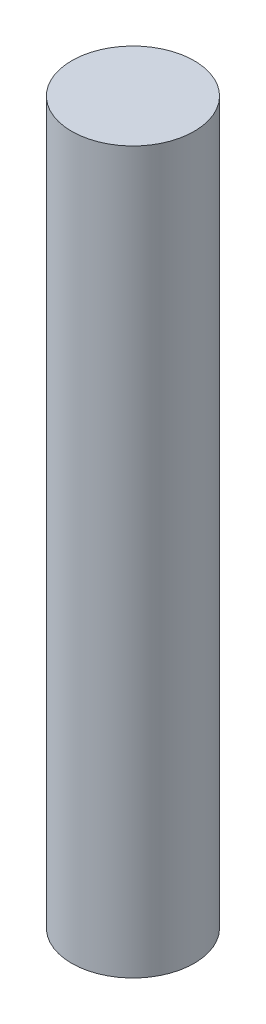
ISO-10303-21;
HEADER;
FILE_DESCRIPTION(('STEP AP214'),'2;1');
FILE_NAME('part.step','',(''),(''),'','','');
FILE_SCHEMA(('AUTOMOTIVE_DESIGN { 1 0 10303 214 1 1 1 1 }'));
ENDSEC;
DATA;
#1=APPLICATION_CONTEXT('core data for automotive mechanical design processes');
#2=APPLICATION_PROTOCOL_DEFINITION('international standard','automotive_design',2000,#1);
#3=PRODUCT_CONTEXT('',#1,'mechanical');
#4=PRODUCT('Part','Part','',(#3));
#5=PRODUCT_RELATED_PRODUCT_CATEGORY('part','',(#4));
#6=PRODUCT_DEFINITION_FORMATION('','',#4);
#7=PRODUCT_DEFINITION_CONTEXT('part definition',#1,'design');
#8=PRODUCT_DEFINITION('design','',#6,#7);
#9=PRODUCT_DEFINITION_SHAPE('','',#8);
#10=(LENGTH_UNIT() NAMED_UNIT(*) SI_UNIT(.MILLI.,.METRE.));
#11=(NAMED_UNIT(*) PLANE_ANGLE_UNIT() SI_UNIT($,.RADIAN.));
#12=(NAMED_UNIT(*) SI_UNIT($,.STERADIAN.) SOLID_ANGLE_UNIT());
#13=UNCERTAINTY_MEASURE_WITH_UNIT(LENGTH_MEASURE(1.E-05),#10,'distance_accuracy_value','');
#14=(GEOMETRIC_REPRESENTATION_CONTEXT(3) GLOBAL_UNCERTAINTY_ASSIGNED_CONTEXT((#13)) GLOBAL_UNIT_ASSIGNED_CONTEXT((#10,
#11,#12)) REPRESENTATION_CONTEXT('',''));
#15=CARTESIAN_POINT('',(0.,0.,0.));
#16=DIRECTION('',(0.,0.,1.));
#17=DIRECTION('',(1.,0.,0.));
#18=AXIS2_PLACEMENT_3D('',#15,#16,#17);
#19=CARTESIAN_POINT('',(0.,100.,0.));
#20=DIRECTION('',(0.,-1.,0.));
#21=DIRECTION('',(0.,0.,-1.));
#22=AXIS2_PLACEMENT_3D('',#19,#20,#21);
#23=CYLINDRICAL_SURFACE('',#22,8.5);
#24=CARTESIAN_POINT('',(0.,100.,0.));
#25=DIRECTION('',(0.,1.,0.));
#26=DIRECTION('',(0.,0.,1.));
#27=AXIS2_PLACEMENT_3D('',#24,#25,#26);
#28=CIRCLE('',#27,8.5);
#29=CARTESIAN_POINT('',(0.,100.,8.5));
#30=VERTEX_POINT('',#29);
#31=EDGE_CURVE('E10',#30,#30,#28,.T.);
#32=ORIENTED_EDGE('',*,*,#31,.F.);
#33=EDGE_LOOP('',(#32));
#34=FACE_BOUND('',#33,.T.);
#35=CARTESIAN_POINT('',(0.,0.,0.));
#36=DIRECTION('',(0.,1.,0.));
#37=DIRECTION('',(0.,0.,1.));
#38=AXIS2_PLACEMENT_3D('',#35,#36,#37);
#39=CIRCLE('',#38,8.5);
#40=CARTESIAN_POINT('',(0.,0.,8.5));
#41=VERTEX_POINT('',#40);
#42=EDGE_CURVE('E42',#41,#41,#39,.T.);
#43=ORIENTED_EDGE('',*,*,#42,.T.);
#44=EDGE_LOOP('',(#43));
#45=FACE_BOUND('',#44,.T.);
#46=ADVANCED_FACE('F39',(#34,#45),#23,.T.);
#47=CARTESIAN_POINT('',(0.,100.,0.));
#48=DIRECTION('',(0.,1.,0.));
#49=DIRECTION('',(0.,0.,1.));
#50=AXIS2_PLACEMENT_3D('',#47,#48,#49);
#51=PLANE('',#50);
#52=ORIENTED_EDGE('',*,*,#31,.T.);
#53=EDGE_LOOP('',(#52));
#54=FACE_BOUND('',#53,.T.);
#55=ADVANCED_FACE('F56',(#54),#51,.T.);
#56=CARTESIAN_POINT('',(0.,0.,0.));
#57=DIRECTION('',(0.,1.,0.));
#58=DIRECTION('',(0.,0.,1.));
#59=AXIS2_PLACEMENT_3D('',#56,#57,#58);
#60=PLANE('',#59);
#61=ORIENTED_EDGE('',*,*,#42,.F.);
#62=EDGE_LOOP('',(#61));
#63=FACE_BOUND('',#62,.T.);
#64=ADVANCED_FACE('F54',(#63),#60,.F.);
#65=CLOSED_SHELL('',(#46,#55,#64));
#66=MANIFOLD_SOLID_BREP('B2',#65);
#67=ADVANCED_BREP_SHAPE_REPRESENTATION('',(#18,#66),#14);
#68=SHAPE_DEFINITION_REPRESENTATION(#9,#67);
ENDSEC;
END-ISO-10303-21;
